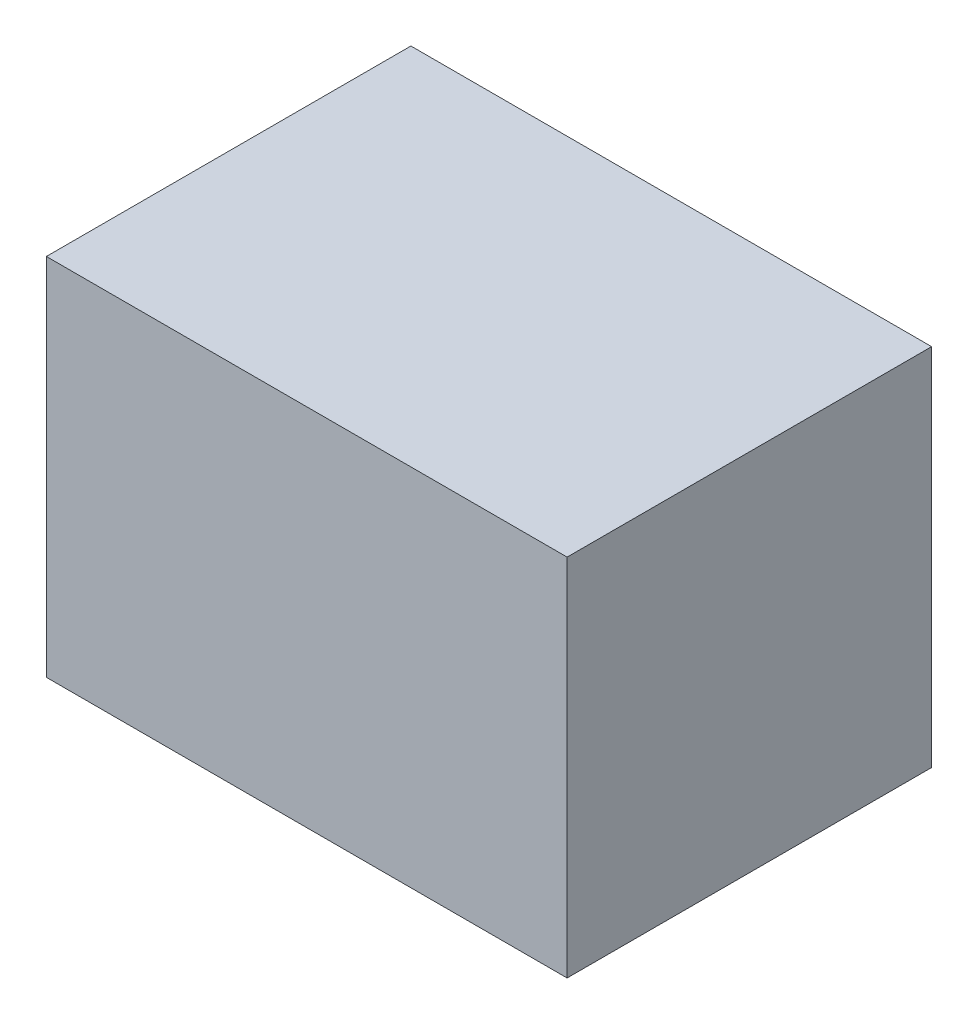
ISO-10303-21;
HEADER;
FILE_DESCRIPTION(('STEP AP214'),'2;1');
FILE_NAME('part.step','',(''),(''),'','','');
FILE_SCHEMA(('AUTOMOTIVE_DESIGN { 1 0 10303 214 1 1 1 1 }'));
ENDSEC;
DATA;
#1=APPLICATION_CONTEXT('core data for automotive mechanical design processes');
#2=APPLICATION_PROTOCOL_DEFINITION('international standard','automotive_design',2000,#1);
#3=PRODUCT_CONTEXT('',#1,'mechanical');
#4=PRODUCT('Part','Part','',(#3));
#5=PRODUCT_RELATED_PRODUCT_CATEGORY('part','',(#4));
#6=PRODUCT_DEFINITION_FORMATION('','',#4);
#7=PRODUCT_DEFINITION_CONTEXT('part definition',#1,'design');
#8=PRODUCT_DEFINITION('design','',#6,#7);
#9=PRODUCT_DEFINITION_SHAPE('','',#8);
#10=(LENGTH_UNIT() NAMED_UNIT(*) SI_UNIT(.MILLI.,.METRE.));
#11=(NAMED_UNIT(*) PLANE_ANGLE_UNIT() SI_UNIT($,.RADIAN.));
#12=(NAMED_UNIT(*) SI_UNIT($,.STERADIAN.) SOLID_ANGLE_UNIT());
#13=UNCERTAINTY_MEASURE_WITH_UNIT(LENGTH_MEASURE(1.E-05),#10,'distance_accuracy_value','');
#14=(GEOMETRIC_REPRESENTATION_CONTEXT(3) GLOBAL_UNCERTAINTY_ASSIGNED_CONTEXT((#13)) GLOBAL_UNIT_ASSIGNED_CONTEXT((#10,
#11,#12)) REPRESENTATION_CONTEXT('',''));
#15=CARTESIAN_POINT('',(0.,0.,0.));
#16=DIRECTION('',(0.,0.,1.));
#17=DIRECTION('',(1.,0.,0.));
#18=AXIS2_PLACEMENT_3D('',#15,#16,#17);
#19=CARTESIAN_POINT('',(-20.32,0.,0.));
#20=DIRECTION('',(0.,1.,0.));
#21=DIRECTION('',(1.,0.,0.));
#22=AXIS2_PLACEMENT_3D('',#19,#20,#21);
#23=PLANE('',#22);
#24=DIRECTION('',(0.,0.,1.));
#25=VECTOR('',#24,1.);
#26=CARTESIAN_POINT('',(-5.33,0.,0.749999999999982));
#27=LINE('',#26,#25);
#28=CARTESIAN_POINT('',(-5.33,0.,0.749999999999982));
#29=VERTEX_POINT('',#28);
#30=CARTESIAN_POINT('',(-5.33,0.,1.1));
#31=VERTEX_POINT('',#30);
#32=EDGE_CURVE('E92',#29,#31,#27,.T.);
#33=ORIENTED_EDGE('',*,*,#32,.T.);
#34=DIRECTION('',(1.,0.,0.));
#35=VECTOR('',#34,1.);
#36=CARTESIAN_POINT('',(-5.33,0.,1.1));
#37=LINE('',#36,#35);
#38=CARTESIAN_POINT('',(-4.83,0.,1.1));
#39=VERTEX_POINT('',#38);
#40=EDGE_CURVE('E27',#31,#39,#37,.T.);
#41=ORIENTED_EDGE('',*,*,#40,.T.);
#42=DIRECTION('',(0.,0.,1.));
#43=VECTOR('',#42,1.);
#44=CARTESIAN_POINT('',(-4.83,0.,0.749999999999982));
#45=LINE('',#44,#43);
#46=CARTESIAN_POINT('',(-4.83,0.,0.749999999999982));
#47=VERTEX_POINT('',#46);
#48=EDGE_CURVE('E100',#47,#39,#45,.T.);
#49=ORIENTED_EDGE('',*,*,#48,.F.);
#50=DIRECTION('',(1.,0.,0.));
#51=VECTOR('',#50,1.);
#52=CARTESIAN_POINT('',(-5.33,0.,0.749999999999982));
#53=LINE('',#52,#51);
#54=EDGE_CURVE('E81',#29,#47,#53,.T.);
#55=ORIENTED_EDGE('',*,*,#54,.F.);
#56=EDGE_LOOP('',(#33,#41,#49,#55));
#57=FACE_BOUND('',#56,.T.);
#58=ADVANCED_FACE('F17',(#57),#23,.T.);
#59=CARTESIAN_POINT('',(-20.32,-0.35,0.));
#60=DIRECTION('',(0.,1.,0.));
#61=DIRECTION('',(1.,0.,0.));
#62=AXIS2_PLACEMENT_3D('',#59,#60,#61);
#63=PLANE('',#62);
#64=DIRECTION('',(0.,0.,1.));
#65=VECTOR('',#64,1.);
#66=CARTESIAN_POINT('',(-5.33,-0.35,0.749999999999982));
#67=LINE('',#66,#65);
#68=CARTESIAN_POINT('',(-5.33,-0.35,0.749999999999982));
#69=VERTEX_POINT('',#68);
#70=CARTESIAN_POINT('',(-5.33,-0.35,1.1));
#71=VERTEX_POINT('',#70);
#72=EDGE_CURVE('E70',#69,#71,#67,.T.);
#73=ORIENTED_EDGE('',*,*,#72,.F.);
#74=DIRECTION('',(1.,0.,0.));
#75=VECTOR('',#74,1.);
#76=CARTESIAN_POINT('',(-5.33,-0.35,0.749999999999982));
#77=LINE('',#76,#75);
#78=CARTESIAN_POINT('',(-4.83,-0.35,0.749999999999982));
#79=VERTEX_POINT('',#78);
#80=EDGE_CURVE('E108',#69,#79,#77,.T.);
#81=ORIENTED_EDGE('',*,*,#80,.T.);
#82=DIRECTION('',(0.,0.,1.));
#83=VECTOR('',#82,1.);
#84=CARTESIAN_POINT('',(-4.83,-0.35,0.749999999999982));
#85=LINE('',#84,#83);
#86=CARTESIAN_POINT('',(-4.83,-0.35,1.1));
#87=VERTEX_POINT('',#86);
#88=EDGE_CURVE('E73',#79,#87,#85,.T.);
#89=ORIENTED_EDGE('',*,*,#88,.T.);
#90=DIRECTION('',(1.,0.,0.));
#91=VECTOR('',#90,1.);
#92=CARTESIAN_POINT('',(-5.33,-0.35,1.1));
#93=LINE('',#92,#91);
#94=EDGE_CURVE('E11',#71,#87,#93,.T.);
#95=ORIENTED_EDGE('',*,*,#94,.F.);
#96=EDGE_LOOP('',(#73,#81,#89,#95));
#97=FACE_BOUND('',#96,.T.);
#98=ADVANCED_FACE('F67',(#97),#63,.F.);
#99=CARTESIAN_POINT('',(-5.33,-0.35,1.1));
#100=DIRECTION('',(0.,0.,1.));
#101=DIRECTION('',(1.,0.,0.));
#102=AXIS2_PLACEMENT_3D('',#99,#100,#101);
#103=PLANE('',#102);
#104=ORIENTED_EDGE('',*,*,#40,.F.);
#105=DIRECTION('',(0.,1.,0.));
#106=VECTOR('',#105,1.);
#107=CARTESIAN_POINT('',(-5.33,-0.35,1.1));
#108=LINE('',#107,#106);
#109=EDGE_CURVE('E20',#71,#31,#108,.T.);
#110=ORIENTED_EDGE('',*,*,#109,.F.);
#111=ORIENTED_EDGE('',*,*,#94,.T.);
#112=DIRECTION('',(0.,1.,0.));
#113=VECTOR('',#112,1.);
#114=CARTESIAN_POINT('',(-4.83,-0.35,1.1));
#115=LINE('',#114,#113);
#116=EDGE_CURVE('E115',#87,#39,#115,.T.);
#117=ORIENTED_EDGE('',*,*,#116,.T.);
#118=EDGE_LOOP('',(#104,#110,#111,#117));
#119=FACE_BOUND('',#118,.T.);
#120=ADVANCED_FACE('F76',(#119),#103,.T.);
#121=CARTESIAN_POINT('',(-4.83,-0.35,0.749999999999982));
#122=DIRECTION('',(-1.,0.,0.));
#123=DIRECTION('',(0.,0.,1.));
#124=AXIS2_PLACEMENT_3D('',#121,#122,#123);
#125=PLANE('',#124);
#126=ORIENTED_EDGE('',*,*,#48,.T.);
#127=ORIENTED_EDGE('',*,*,#116,.F.);
#128=ORIENTED_EDGE('',*,*,#88,.F.);
#129=DIRECTION('',(0.,1.,0.));
#130=VECTOR('',#129,1.);
#131=CARTESIAN_POINT('',(-4.83,-0.35,0.749999999999982));
#132=LINE('',#131,#130);
#133=EDGE_CURVE('E105',#79,#47,#132,.T.);
#134=ORIENTED_EDGE('',*,*,#133,.T.);
#135=EDGE_LOOP('',(#126,#127,#128,#134));
#136=FACE_BOUND('',#135,.T.);
#137=ADVANCED_FACE('F162',(#136),#125,.F.);
#138=CARTESIAN_POINT('',(-5.33,-0.35,0.749999999999982));
#139=DIRECTION('',(0.,0.,1.));
#140=DIRECTION('',(1.,0.,0.));
#141=AXIS2_PLACEMENT_3D('',#138,#139,#140);
#142=PLANE('',#141);
#143=ORIENTED_EDGE('',*,*,#54,.T.);
#144=ORIENTED_EDGE('',*,*,#133,.F.);
#145=ORIENTED_EDGE('',*,*,#80,.F.);
#146=DIRECTION('',(0.,1.,0.));
#147=VECTOR('',#146,1.);
#148=CARTESIAN_POINT('',(-5.33,-0.35,0.749999999999982));
#149=LINE('',#148,#147);
#150=EDGE_CURVE('E84',#69,#29,#149,.T.);
#151=ORIENTED_EDGE('',*,*,#150,.T.);
#152=EDGE_LOOP('',(#143,#144,#145,#151));
#153=FACE_BOUND('',#152,.T.);
#154=ADVANCED_FACE('F107',(#153),#142,.F.);
#155=CARTESIAN_POINT('',(-5.33,-0.35,0.749999999999982));
#156=DIRECTION('',(-1.,0.,0.));
#157=DIRECTION('',(0.,0.,1.));
#158=AXIS2_PLACEMENT_3D('',#155,#156,#157);
#159=PLANE('',#158);
#160=ORIENTED_EDGE('',*,*,#32,.F.);
#161=ORIENTED_EDGE('',*,*,#150,.F.);
#162=ORIENTED_EDGE('',*,*,#72,.T.);
#163=ORIENTED_EDGE('',*,*,#109,.T.);
#164=EDGE_LOOP('',(#160,#161,#162,#163));
#165=FACE_BOUND('',#164,.T.);
#166=ADVANCED_FACE('F82',(#165),#159,.T.);
#167=CLOSED_SHELL('',(#58,#98,#120,#137,#154,#166));
#168=MANIFOLD_SOLID_BREP('B1',#167);
#169=ADVANCED_BREP_SHAPE_REPRESENTATION('',(#18,#168),#14);
#170=SHAPE_DEFINITION_REPRESENTATION(#9,#169);
ENDSEC;
END-ISO-10303-21;
